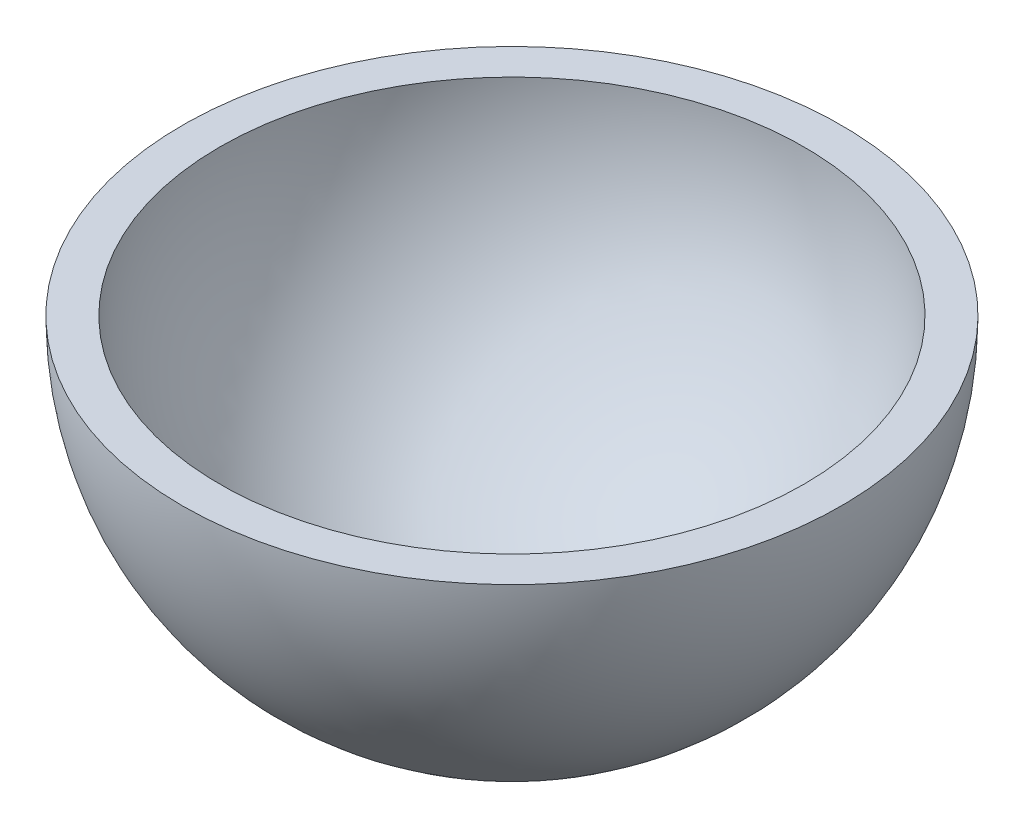
ISO-10303-21;
HEADER;
FILE_DESCRIPTION(('STEP AP214'),'2;1');
FILE_NAME('part.step','',(''),(''),'','','');
FILE_SCHEMA(('AUTOMOTIVE_DESIGN { 1 0 10303 214 1 1 1 1 }'));
ENDSEC;
DATA;
#1=APPLICATION_CONTEXT('core data for automotive mechanical design processes');
#2=APPLICATION_PROTOCOL_DEFINITION('international standard','automotive_design',2000,#1);
#3=PRODUCT_CONTEXT('',#1,'mechanical');
#4=PRODUCT('Part','Part','',(#3));
#5=PRODUCT_RELATED_PRODUCT_CATEGORY('part','',(#4));
#6=PRODUCT_DEFINITION_FORMATION('','',#4);
#7=PRODUCT_DEFINITION_CONTEXT('part definition',#1,'design');
#8=PRODUCT_DEFINITION('design','',#6,#7);
#9=PRODUCT_DEFINITION_SHAPE('','',#8);
#10=(LENGTH_UNIT() NAMED_UNIT(*) SI_UNIT(.MILLI.,.METRE.));
#11=(NAMED_UNIT(*) PLANE_ANGLE_UNIT() SI_UNIT($,.RADIAN.));
#12=(NAMED_UNIT(*) SI_UNIT($,.STERADIAN.) SOLID_ANGLE_UNIT());
#13=UNCERTAINTY_MEASURE_WITH_UNIT(LENGTH_MEASURE(1.E-05),#10,'distance_accuracy_value','');
#14=(GEOMETRIC_REPRESENTATION_CONTEXT(3) GLOBAL_UNCERTAINTY_ASSIGNED_CONTEXT((#13)) GLOBAL_UNIT_ASSIGNED_CONTEXT((#10,
#11,#12)) REPRESENTATION_CONTEXT('',''));
#15=CARTESIAN_POINT('',(0.,0.,0.));
#16=DIRECTION('',(0.,0.,1.));
#17=DIRECTION('',(1.,0.,0.));
#18=AXIS2_PLACEMENT_3D('',#15,#16,#17);
#19=CARTESIAN_POINT('',(0.,0.,11.));
#20=DIRECTION('',(0.,0.,-1.));
#21=DIRECTION('',(-1.,0.,0.));
#22=AXIS2_PLACEMENT_3D('',#19,#20,#21);
#23=SPHERICAL_SURFACE('',#22,11.);
#24=CARTESIAN_POINT('',(0.,0.,11.));
#25=DIRECTION('',(0.,-1.,0.));
#26=DIRECTION('',(0.,0.,1.));
#27=AXIS2_PLACEMENT_3D('',#24,#25,#26);
#28=SPHERICAL_SURFACE('',#27,11.);
#29=CARTESIAN_POINT('',(0.,0.,11.));
#30=DIRECTION('',(0.,-1.,0.));
#31=DIRECTION('',(0.,0.,1.));
#32=AXIS2_PLACEMENT_3D('',#29,#30,#31);
#33=CIRCLE('',#32,11.);
#34=CARTESIAN_POINT('',(0.,0.,22.));
#35=VERTEX_POINT('',#34);
#36=EDGE_CURVE('E10',#35,#35,#33,.T.);
#37=ORIENTED_EDGE('',*,*,#36,.T.);
#38=EDGE_LOOP('',(#37));
#39=FACE_BOUND('',#38,.T.);
#40=ADVANCED_FACE('F39',(#39),#28,.T.);
#41=CARTESIAN_POINT('',(0.,0.,11.));
#42=DIRECTION('',(0.,1.,0.));
#43=DIRECTION('',(0.,0.,1.));
#44=AXIS2_PLACEMENT_3D('',#41,#42,#43);
#45=PLANE('',#44);
#46=CARTESIAN_POINT('',(0.,0.,11.));
#47=DIRECTION('',(0.,-1.,0.));
#48=DIRECTION('',(-1.,0.,0.));
#49=AXIS2_PLACEMENT_3D('',#46,#47,#48);
#50=CIRCLE('',#49,9.75);
#51=CARTESIAN_POINT('',(-9.75,0.,11.));
#52=VERTEX_POINT('',#51);
#53=EDGE_CURVE('E45',#52,#52,#50,.T.);
#54=ORIENTED_EDGE('',*,*,#53,.T.);
#55=EDGE_LOOP('',(#54));
#56=FACE_BOUND('',#55,.T.);
#57=ORIENTED_EDGE('',*,*,#36,.F.);
#58=EDGE_LOOP('',(#57));
#59=FACE_BOUND('',#58,.T.);
#60=ADVANCED_FACE('F51',(#56,#59),#45,.T.);
#61=CARTESIAN_POINT('',(0.,0.,11.));
#62=DIRECTION('',(0.,0.,-1.));
#63=DIRECTION('',(-1.,0.,0.));
#64=AXIS2_PLACEMENT_3D('',#61,#62,#63);
#65=SPHERICAL_SURFACE('',#64,9.75);
#66=CARTESIAN_POINT('',(0.,0.,11.));
#67=DIRECTION('',(0.,-1.,0.));
#68=DIRECTION('',(-1.,0.,0.));
#69=AXIS2_PLACEMENT_3D('',#66,#67,#68);
#70=SPHERICAL_SURFACE('',#69,9.75);
#71=ORIENTED_EDGE('',*,*,#53,.F.);
#72=EDGE_LOOP('',(#71));
#73=FACE_BOUND('',#72,.T.);
#74=ADVANCED_FACE('F54',(#73),#70,.F.);
#75=CLOSED_SHELL('',(#40,#60,#74));
#76=MANIFOLD_SOLID_BREP('B2',#75);
#77=ADVANCED_BREP_SHAPE_REPRESENTATION('',(#18,#76),#14);
#78=SHAPE_DEFINITION_REPRESENTATION(#9,#77);
ENDSEC;
END-ISO-10303-21;
